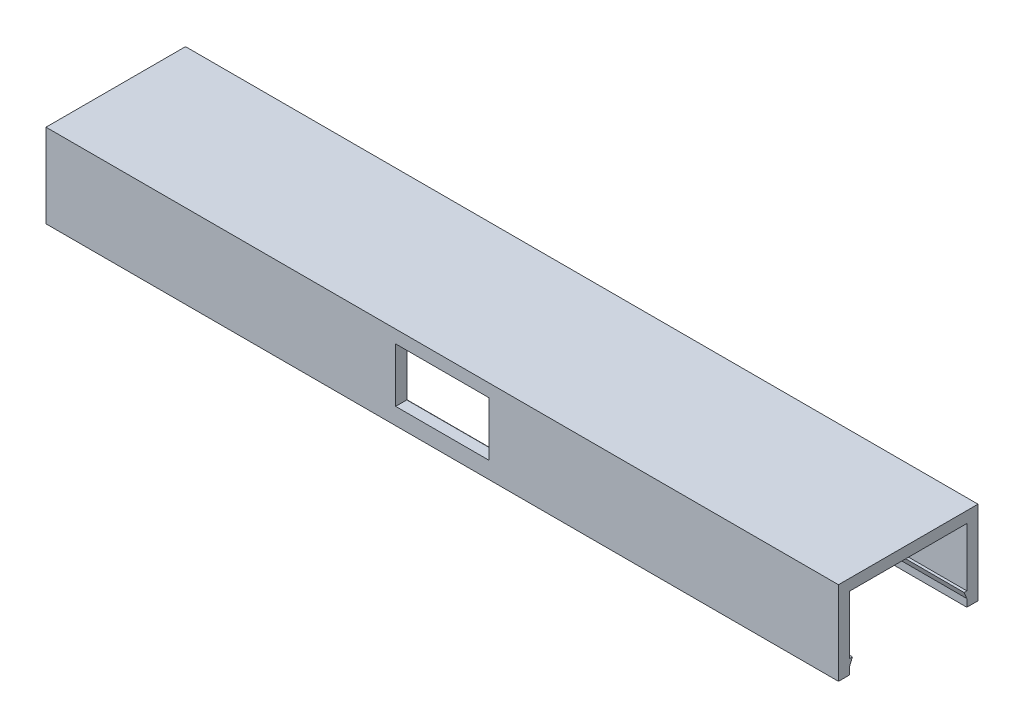
ISO-10303-21;
HEADER;
FILE_DESCRIPTION(('STEP AP214'),'2;1');
FILE_NAME('part.step','',(''),(''),'','','');
FILE_SCHEMA(('AUTOMOTIVE_DESIGN { 1 0 10303 214 1 1 1 1 }'));
ENDSEC;
DATA;
#1=APPLICATION_CONTEXT('core data for automotive mechanical design processes');
#2=APPLICATION_PROTOCOL_DEFINITION('international standard','automotive_design',2000,#1);
#3=PRODUCT_CONTEXT('',#1,'mechanical');
#4=PRODUCT('Part','Part','',(#3));
#5=PRODUCT_RELATED_PRODUCT_CATEGORY('part','',(#4));
#6=PRODUCT_DEFINITION_FORMATION('','',#4);
#7=PRODUCT_DEFINITION_CONTEXT('part definition',#1,'design');
#8=PRODUCT_DEFINITION('design','',#6,#7);
#9=PRODUCT_DEFINITION_SHAPE('','',#8);
#10=(LENGTH_UNIT() NAMED_UNIT(*) SI_UNIT(.MILLI.,.METRE.));
#11=(NAMED_UNIT(*) PLANE_ANGLE_UNIT() SI_UNIT($,.RADIAN.));
#12=(NAMED_UNIT(*) SI_UNIT($,.STERADIAN.) SOLID_ANGLE_UNIT());
#13=UNCERTAINTY_MEASURE_WITH_UNIT(LENGTH_MEASURE(1.E-05),#10,'distance_accuracy_value','');
#14=(GEOMETRIC_REPRESENTATION_CONTEXT(3) GLOBAL_UNCERTAINTY_ASSIGNED_CONTEXT((#13)) GLOBAL_UNIT_ASSIGNED_CONTEXT((#10,
#11,#12)) REPRESENTATION_CONTEXT('',''));
#15=CARTESIAN_POINT('',(0.,0.,0.));
#16=DIRECTION('',(0.,0.,1.));
#17=DIRECTION('',(1.,0.,0.));
#18=AXIS2_PLACEMENT_3D('',#15,#16,#17);
#19=CARTESIAN_POINT('',(159.,13.,10.5));
#20=DIRECTION('',(0.,0.,1.));
#21=DIRECTION('',(1.,0.,0.));
#22=AXIS2_PLACEMENT_3D('',#19,#20,#21);
#23=PLANE('',#22);
#24=DIRECTION('',(-1.,0.,0.));
#25=VECTOR('',#24,1.);
#26=CARTESIAN_POINT('',(159.,12.7,10.5));
#27=LINE('',#26,#25);
#28=CARTESIAN_POINT('',(8.35,12.7,10.5));
#29=VERTEX_POINT('',#28);
#30=CARTESIAN_POINT('',(-8.35,12.7,10.5));
#31=VERTEX_POINT('',#30);
#32=EDGE_CURVE('E191',#29,#31,#27,.T.);
#33=ORIENTED_EDGE('',*,*,#32,.T.);
#34=DIRECTION('',(0.,-1.,0.));
#35=VECTOR('',#34,1.);
#36=CARTESIAN_POINT('',(-8.35,13.,10.5));
#37=LINE('',#36,#35);
#38=CARTESIAN_POINT('',(-8.35,3.,10.5));
#39=VERTEX_POINT('',#38);
#40=EDGE_CURVE('E194',#31,#39,#37,.T.);
#41=ORIENTED_EDGE('',*,*,#40,.T.);
#42=DIRECTION('',(1.,0.,0.));
#43=VECTOR('',#42,1.);
#44=CARTESIAN_POINT('',(159.,3.,10.5));
#45=LINE('',#44,#43);
#46=CARTESIAN_POINT('',(8.35,3.,10.5));
#47=VERTEX_POINT('',#46);
#48=EDGE_CURVE('E186',#39,#47,#45,.T.);
#49=ORIENTED_EDGE('',*,*,#48,.T.);
#50=DIRECTION('',(0.,1.,0.));
#51=VECTOR('',#50,1.);
#52=CARTESIAN_POINT('',(8.35,12.9999999999999,10.5));
#53=LINE('',#52,#51);
#54=EDGE_CURVE('E166',#47,#29,#53,.T.);
#55=ORIENTED_EDGE('',*,*,#54,.T.);
#56=EDGE_LOOP('',(#33,#41,#49,#55));
#57=FACE_BOUND('',#56,.T.);
#58=DIRECTION('',(0.,1.,0.));
#59=VECTOR('',#58,1.);
#60=CARTESIAN_POINT('',(71.,15.,10.5));
#61=LINE('',#60,#59);
#62=CARTESIAN_POINT('',(71.,2.55,10.5));
#63=VERTEX_POINT('',#62);
#64=CARTESIAN_POINT('',(71.,13.,10.5));
#65=VERTEX_POINT('',#64);
#66=EDGE_CURVE('E253',#63,#65,#61,.T.);
#67=ORIENTED_EDGE('',*,*,#66,.F.);
#68=DIRECTION('',(-1.,0.,0.));
#69=VECTOR('',#68,1.);
#70=CARTESIAN_POINT('',(72.3,2.55,10.5));
#71=LINE('',#70,#69);
#72=CARTESIAN_POINT('',(-71.,2.55,10.5));
#73=VERTEX_POINT('',#72);
#74=EDGE_CURVE('E202',#63,#73,#71,.T.);
#75=ORIENTED_EDGE('',*,*,#74,.T.);
#76=DIRECTION('',(0.,1.,0.));
#77=VECTOR('',#76,1.);
#78=CARTESIAN_POINT('',(-71.,13.,10.5));
#79=LINE('',#78,#77);
#80=CARTESIAN_POINT('',(-71.,13.,10.5));
#81=VERTEX_POINT('',#80);
#82=EDGE_CURVE('E240',#73,#81,#79,.T.);
#83=ORIENTED_EDGE('',*,*,#82,.T.);
#84=DIRECTION('',(-1.,0.,0.));
#85=VECTOR('',#84,1.);
#86=CARTESIAN_POINT('',(159.,13.,10.5));
#87=LINE('',#86,#85);
#88=EDGE_CURVE('E245',#65,#81,#87,.T.);
#89=ORIENTED_EDGE('',*,*,#88,.F.);
#90=EDGE_LOOP('',(#67,#75,#83,#89));
#91=FACE_BOUND('',#90,.T.);
#92=ADVANCED_FACE('F35',(#57,#91),#23,.F.);
#93=CARTESIAN_POINT('',(159.,13.,-10.5));
#94=DIRECTION('',(0.,0.,-1.));
#95=DIRECTION('',(-1.,0.,0.));
#96=AXIS2_PLACEMENT_3D('',#93,#94,#95);
#97=PLANE('',#96);
#98=DIRECTION('',(0.,-1.,0.));
#99=VECTOR('',#98,1.);
#100=CARTESIAN_POINT('',(71.,15.,-10.5));
#101=LINE('',#100,#99);
#102=CARTESIAN_POINT('',(71.,1.35,-10.5));
#103=VERTEX_POINT('',#102);
#104=CARTESIAN_POINT('',(71.,0.,-10.5));
#105=VERTEX_POINT('',#104);
#106=EDGE_CURVE('E248',#103,#105,#101,.T.);
#107=ORIENTED_EDGE('',*,*,#106,.F.);
#108=DIRECTION('',(-1.,0.,0.));
#109=VECTOR('',#108,1.);
#110=CARTESIAN_POINT('',(72.3,1.35,-10.5));
#111=LINE('',#110,#109);
#112=CARTESIAN_POINT('',(-71.,1.35,-10.5));
#113=VERTEX_POINT('',#112);
#114=EDGE_CURVE('E220',#103,#113,#111,.T.);
#115=ORIENTED_EDGE('',*,*,#114,.T.);
#116=DIRECTION('',(0.,-1.,0.));
#117=VECTOR('',#116,1.);
#118=CARTESIAN_POINT('',(-71.,13.,-10.5));
#119=LINE('',#118,#117);
#120=CARTESIAN_POINT('',(-71.,0.,-10.5));
#121=VERTEX_POINT('',#120);
#122=EDGE_CURVE('E236',#113,#121,#119,.T.);
#123=ORIENTED_EDGE('',*,*,#122,.T.);
#124=DIRECTION('',(-1.,0.,0.));
#125=VECTOR('',#124,1.);
#126=CARTESIAN_POINT('',(0.,0.,-10.5));
#127=LINE('',#126,#125);
#128=EDGE_CURVE('E43',#105,#121,#127,.T.);
#129=ORIENTED_EDGE('',*,*,#128,.F.);
#130=EDGE_LOOP('',(#107,#115,#123,#129));
#131=FACE_BOUND('',#130,.T.);
#132=ADVANCED_FACE('F314',(#131),#97,.F.);
#133=CARTESIAN_POINT('',(0.,0.,0.));
#134=DIRECTION('',(0.,1.,0.));
#135=DIRECTION('',(0.,0.,1.));
#136=AXIS2_PLACEMENT_3D('',#133,#134,#135);
#137=PLANE('',#136);
#138=DIRECTION('',(0.,0.,-1.));
#139=VECTOR('',#138,1.);
#140=CARTESIAN_POINT('',(-71.,0.,0.));
#141=LINE('',#140,#139);
#142=CARTESIAN_POINT('',(-71.,0.,12.5));
#143=VERTEX_POINT('',#142);
#144=CARTESIAN_POINT('',(-71.,0.,10.5));
#145=VERTEX_POINT('',#144);
#146=EDGE_CURVE('E280',#143,#145,#141,.T.);
#147=ORIENTED_EDGE('',*,*,#146,.T.);
#148=DIRECTION('',(1.,0.,0.));
#149=VECTOR('',#148,1.);
#150=CARTESIAN_POINT('',(0.,0.,10.5));
#151=LINE('',#150,#149);
#152=CARTESIAN_POINT('',(71.,0.,10.5));
#153=VERTEX_POINT('',#152);
#154=EDGE_CURVE('E11',#145,#153,#151,.T.);
#155=ORIENTED_EDGE('',*,*,#154,.T.);
#156=DIRECTION('',(0.,0.,-1.));
#157=VECTOR('',#156,1.);
#158=CARTESIAN_POINT('',(71.,0.,0.));
#159=LINE('',#158,#157);
#160=CARTESIAN_POINT('',(71.,0.,12.5));
#161=VERTEX_POINT('',#160);
#162=EDGE_CURVE('E273',#161,#153,#159,.T.);
#163=ORIENTED_EDGE('',*,*,#162,.F.);
#164=DIRECTION('',(1.,0.,0.));
#165=VECTOR('',#164,1.);
#166=CARTESIAN_POINT('',(0.,0.,12.5));
#167=LINE('',#166,#165);
#168=EDGE_CURVE('E264',#143,#161,#167,.T.);
#169=ORIENTED_EDGE('',*,*,#168,.F.);
#170=EDGE_LOOP('',(#147,#155,#163,#169));
#171=FACE_BOUND('',#170,.T.);
#172=ADVANCED_FACE('F346',(#171),#137,.F.);
#173=CARTESIAN_POINT('',(71.,15.,0.));
#174=DIRECTION('',(-1.,0.,0.));
#175=DIRECTION('',(0.,0.,1.));
#176=AXIS2_PLACEMENT_3D('',#173,#174,#175);
#177=PLANE('',#176);
#178=ORIENTED_EDGE('',*,*,#162,.T.);
#179=CARTESIAN_POINT('',(71.,1.35,10.5));
#180=VERTEX_POINT('',#179);
#181=EDGE_CURVE('E254',#153,#180,#61,.T.);
#182=ORIENTED_EDGE('',*,*,#181,.T.);
#183=DIRECTION('',(0.,0.923076923076923,-0.384615384615384));
#184=VECTOR('',#183,1.);
#185=CARTESIAN_POINT('',(71.,2.55,10.));
#186=LINE('',#185,#184);
#187=CARTESIAN_POINT('',(71.,2.55,10.));
#188=VERTEX_POINT('',#187);
#189=EDGE_CURVE('E201',#180,#188,#186,.T.);
#190=ORIENTED_EDGE('',*,*,#189,.T.);
#191=DIRECTION('',(0.,0.,1.));
#192=VECTOR('',#191,1.);
#193=CARTESIAN_POINT('',(71.,2.55,10.5));
#194=LINE('',#193,#192);
#195=EDGE_CURVE('E198',#188,#63,#194,.T.);
#196=ORIENTED_EDGE('',*,*,#195,.T.);
#197=ORIENTED_EDGE('',*,*,#66,.T.);
#198=DIRECTION('',(0.,0.,-1.));
#199=VECTOR('',#198,1.);
#200=CARTESIAN_POINT('',(71.,13.,0.));
#201=LINE('',#200,#199);
#202=CARTESIAN_POINT('',(71.,13.,-10.5));
#203=VERTEX_POINT('',#202);
#204=EDGE_CURVE('E257',#65,#203,#201,.T.);
#205=ORIENTED_EDGE('',*,*,#204,.T.);
#206=CARTESIAN_POINT('',(71.,2.55,-10.5));
#207=VERTEX_POINT('',#206);
#208=EDGE_CURVE('E250',#203,#207,#101,.T.);
#209=ORIENTED_EDGE('',*,*,#208,.T.);
#210=DIRECTION('',(0.,0.,1.));
#211=VECTOR('',#210,1.);
#212=CARTESIAN_POINT('',(71.,2.55,-10.5));
#213=LINE('',#212,#211);
#214=CARTESIAN_POINT('',(71.,2.55,-10.));
#215=VERTEX_POINT('',#214);
#216=EDGE_CURVE('E219',#207,#215,#213,.T.);
#217=ORIENTED_EDGE('',*,*,#216,.T.);
#218=DIRECTION('',(0.,-0.923076923076923,-0.384615384615384));
#219=VECTOR('',#218,1.);
#220=CARTESIAN_POINT('',(71.,2.55,-10.));
#221=LINE('',#220,#219);
#222=EDGE_CURVE('E216',#215,#103,#221,.T.);
#223=ORIENTED_EDGE('',*,*,#222,.T.);
#224=ORIENTED_EDGE('',*,*,#106,.T.);
#225=CARTESIAN_POINT('',(71.,0.,-12.5));
#226=VERTEX_POINT('',#225);
#227=EDGE_CURVE('E260',#105,#226,#159,.T.);
#228=ORIENTED_EDGE('',*,*,#227,.T.);
#229=DIRECTION('',(0.,-1.,0.));
#230=VECTOR('',#229,1.);
#231=CARTESIAN_POINT('',(71.,15.,-12.5));
#232=LINE('',#231,#230);
#233=CARTESIAN_POINT('',(71.,15.,-12.5));
#234=VERTEX_POINT('',#233);
#235=EDGE_CURVE('E291',#234,#226,#232,.T.);
#236=ORIENTED_EDGE('',*,*,#235,.F.);
#237=DIRECTION('',(0.,0.,-1.));
#238=VECTOR('',#237,1.);
#239=CARTESIAN_POINT('',(71.,15.,0.));
#240=LINE('',#239,#238);
#241=CARTESIAN_POINT('',(71.,15.,12.5));
#242=VERTEX_POINT('',#241);
#243=EDGE_CURVE('E261',#242,#234,#240,.T.);
#244=ORIENTED_EDGE('',*,*,#243,.F.);
#245=DIRECTION('',(0.,-1.,0.));
#246=VECTOR('',#245,1.);
#247=CARTESIAN_POINT('',(71.,15.,12.5));
#248=LINE('',#247,#246);
#249=EDGE_CURVE('E272',#242,#161,#248,.T.);
#250=ORIENTED_EDGE('',*,*,#249,.T.);
#251=EDGE_LOOP('',(#178,#182,#190,#196,#197,#205,#209,#217,#223,#224,#228,#236,#244,#250));
#252=FACE_BOUND('',#251,.T.);
#253=ADVANCED_FACE('F37',(#252),#177,.F.);
#254=CARTESIAN_POINT('',(0.,15.,-12.5));
#255=DIRECTION('',(0.,0.,-1.));
#256=DIRECTION('',(-1.,0.,0.));
#257=AXIS2_PLACEMENT_3D('',#254,#255,#256);
#258=PLANE('',#257);
#259=DIRECTION('',(1.,0.,0.));
#260=VECTOR('',#259,1.);
#261=CARTESIAN_POINT('',(0.,0.,-12.5));
#262=LINE('',#261,#260);
#263=CARTESIAN_POINT('',(-71.,0.,-12.5));
#264=VERTEX_POINT('',#263);
#265=EDGE_CURVE('E276',#264,#226,#262,.T.);
#266=ORIENTED_EDGE('',*,*,#265,.F.);
#267=DIRECTION('',(0.,-1.,0.));
#268=VECTOR('',#267,1.);
#269=CARTESIAN_POINT('',(-71.,15.,-12.5));
#270=LINE('',#269,#268);
#271=CARTESIAN_POINT('',(-71.,15.,-12.5));
#272=VERTEX_POINT('',#271);
#273=EDGE_CURVE('E288',#272,#264,#270,.T.);
#274=ORIENTED_EDGE('',*,*,#273,.F.);
#275=DIRECTION('',(1.,0.,0.));
#276=VECTOR('',#275,1.);
#277=CARTESIAN_POINT('',(0.,15.,-12.5));
#278=LINE('',#277,#276);
#279=EDGE_CURVE('E263',#272,#234,#278,.T.);
#280=ORIENTED_EDGE('',*,*,#279,.T.);
#281=ORIENTED_EDGE('',*,*,#235,.T.);
#282=EDGE_LOOP('',(#266,#274,#280,#281));
#283=FACE_BOUND('',#282,.T.);
#284=ADVANCED_FACE('F309',(#283),#258,.T.);
#285=CARTESIAN_POINT('',(-71.,15.,0.));
#286=DIRECTION('',(-1.,0.,0.));
#287=DIRECTION('',(0.,0.,1.));
#288=AXIS2_PLACEMENT_3D('',#285,#286,#287);
#289=PLANE('',#288);
#290=CARTESIAN_POINT('',(-71.,1.35,10.5));
#291=VERTEX_POINT('',#290);
#292=EDGE_CURVE('E241',#145,#291,#79,.T.);
#293=ORIENTED_EDGE('',*,*,#292,.F.);
#294=ORIENTED_EDGE('',*,*,#146,.F.);
#295=DIRECTION('',(0.,-1.,0.));
#296=VECTOR('',#295,1.);
#297=CARTESIAN_POINT('',(-71.,15.,12.5));
#298=LINE('',#297,#296);
#299=CARTESIAN_POINT('',(-71.,15.,12.5));
#300=VERTEX_POINT('',#299);
#301=EDGE_CURVE('E286',#300,#143,#298,.T.);
#302=ORIENTED_EDGE('',*,*,#301,.F.);
#303=DIRECTION('',(0.,0.,-1.));
#304=VECTOR('',#303,1.);
#305=CARTESIAN_POINT('',(-71.,15.,0.));
#306=LINE('',#305,#304);
#307=EDGE_CURVE('E267',#300,#272,#306,.T.);
#308=ORIENTED_EDGE('',*,*,#307,.T.);
#309=ORIENTED_EDGE('',*,*,#273,.T.);
#310=EDGE_CURVE('E279',#121,#264,#141,.T.);
#311=ORIENTED_EDGE('',*,*,#310,.F.);
#312=ORIENTED_EDGE('',*,*,#122,.F.);
#313=DIRECTION('',(0.,0.923076923076923,0.384615384615384));
#314=VECTOR('',#313,1.);
#315=CARTESIAN_POINT('',(-71.,2.55,-10.));
#316=LINE('',#315,#314);
#317=CARTESIAN_POINT('',(-71.,2.55,-10.));
#318=VERTEX_POINT('',#317);
#319=EDGE_CURVE('E215',#113,#318,#316,.T.);
#320=ORIENTED_EDGE('',*,*,#319,.T.);
#321=DIRECTION('',(0.,0.,-1.));
#322=VECTOR('',#321,1.);
#323=CARTESIAN_POINT('',(-71.,2.55,-10.5));
#324=LINE('',#323,#322);
#325=CARTESIAN_POINT('',(-71.,2.55,-10.5));
#326=VERTEX_POINT('',#325);
#327=EDGE_CURVE('E223',#318,#326,#324,.T.);
#328=ORIENTED_EDGE('',*,*,#327,.T.);
#329=CARTESIAN_POINT('',(-71.,13.,-10.5));
#330=VERTEX_POINT('',#329);
#331=EDGE_CURVE('E237',#330,#326,#119,.T.);
#332=ORIENTED_EDGE('',*,*,#331,.F.);
#333=DIRECTION('',(0.,0.,-1.));
#334=VECTOR('',#333,1.);
#335=CARTESIAN_POINT('',(-71.,13.,-10.5));
#336=LINE('',#335,#334);
#337=EDGE_CURVE('E233',#81,#330,#336,.T.);
#338=ORIENTED_EDGE('',*,*,#337,.F.);
#339=ORIENTED_EDGE('',*,*,#82,.F.);
#340=DIRECTION('',(0.,0.,-1.));
#341=VECTOR('',#340,1.);
#342=CARTESIAN_POINT('',(-71.,2.55,10.5));
#343=LINE('',#342,#341);
#344=CARTESIAN_POINT('',(-71.,2.55,10.));
#345=VERTEX_POINT('',#344);
#346=EDGE_CURVE('E197',#73,#345,#343,.T.);
#347=ORIENTED_EDGE('',*,*,#346,.T.);
#348=DIRECTION('',(0.,-0.923076923076923,0.384615384615384));
#349=VECTOR('',#348,1.);
#350=CARTESIAN_POINT('',(-71.,2.55,10.));
#351=LINE('',#350,#349);
#352=EDGE_CURVE('E205',#345,#291,#351,.T.);
#353=ORIENTED_EDGE('',*,*,#352,.T.);
#354=EDGE_LOOP('',(#293,#294,#302,#308,#309,#311,#312,#320,#328,#332,#338,#339,#347,#353));
#355=FACE_BOUND('',#354,.T.);
#356=ADVANCED_FACE('F304',(#355),#289,.T.);
#357=CARTESIAN_POINT('',(0.,15.,12.5));
#358=DIRECTION('',(0.,0.,-1.));
#359=DIRECTION('',(-1.,0.,0.));
#360=AXIS2_PLACEMENT_3D('',#357,#358,#359);
#361=PLANE('',#360);
#362=DIRECTION('',(1.,0.,0.));
#363=VECTOR('',#362,1.);
#364=CARTESIAN_POINT('',(-8.35,3.,12.5));
#365=LINE('',#364,#363);
#366=CARTESIAN_POINT('',(-8.35,3.,12.5));
#367=VERTEX_POINT('',#366);
#368=CARTESIAN_POINT('',(8.35,3.,12.5));
#369=VERTEX_POINT('',#368);
#370=EDGE_CURVE('E172',#367,#369,#365,.T.);
#371=ORIENTED_EDGE('',*,*,#370,.F.);
#372=DIRECTION('',(0.,-1.,0.));
#373=VECTOR('',#372,1.);
#374=CARTESIAN_POINT('',(-8.35,3.,12.5));
#375=LINE('',#374,#373);
#376=CARTESIAN_POINT('',(-8.35,12.7,12.5));
#377=VERTEX_POINT('',#376);
#378=EDGE_CURVE('E58',#377,#367,#375,.T.);
#379=ORIENTED_EDGE('',*,*,#378,.F.);
#380=DIRECTION('',(-1.,0.,0.));
#381=VECTOR('',#380,1.);
#382=CARTESIAN_POINT('',(-8.35,12.7,12.5));
#383=LINE('',#382,#381);
#384=CARTESIAN_POINT('',(8.35,12.7,12.5));
#385=VERTEX_POINT('',#384);
#386=EDGE_CURVE('E179',#385,#377,#383,.T.);
#387=ORIENTED_EDGE('',*,*,#386,.F.);
#388=DIRECTION('',(0.,1.,0.));
#389=VECTOR('',#388,1.);
#390=CARTESIAN_POINT('',(8.35,3.,12.5));
#391=LINE('',#390,#389);
#392=EDGE_CURVE('E163',#369,#385,#391,.T.);
#393=ORIENTED_EDGE('',*,*,#392,.F.);
#394=EDGE_LOOP('',(#371,#379,#387,#393));
#395=FACE_BOUND('',#394,.T.);
#396=ORIENTED_EDGE('',*,*,#168,.T.);
#397=ORIENTED_EDGE('',*,*,#249,.F.);
#398=DIRECTION('',(1.,0.,0.));
#399=VECTOR('',#398,1.);
#400=CARTESIAN_POINT('',(0.,15.,12.5));
#401=LINE('',#400,#399);
#402=EDGE_CURVE('E270',#300,#242,#401,.T.);
#403=ORIENTED_EDGE('',*,*,#402,.F.);
#404=ORIENTED_EDGE('',*,*,#301,.T.);
#405=EDGE_LOOP('',(#396,#397,#403,#404));
#406=FACE_BOUND('',#405,.T.);
#407=ADVANCED_FACE('F176',(#395,#406),#361,.F.);
#408=CARTESIAN_POINT('',(0.,15.,0.));
#409=DIRECTION('',(0.,1.,0.));
#410=DIRECTION('',(0.,0.,1.));
#411=AXIS2_PLACEMENT_3D('',#408,#409,#410);
#412=PLANE('',#411);
#413=ORIENTED_EDGE('',*,*,#243,.T.);
#414=ORIENTED_EDGE('',*,*,#279,.F.);
#415=ORIENTED_EDGE('',*,*,#307,.F.);
#416=ORIENTED_EDGE('',*,*,#402,.T.);
#417=EDGE_LOOP('',(#413,#414,#415,#416));
#418=FACE_BOUND('',#417,.T.);
#419=ADVANCED_FACE('F351',(#418),#412,.T.);
#420=ORIENTED_EDGE('',*,*,#227,.F.);
#421=ORIENTED_EDGE('',*,*,#128,.T.);
#422=ORIENTED_EDGE('',*,*,#310,.T.);
#423=ORIENTED_EDGE('',*,*,#265,.T.);
#424=EDGE_LOOP('',(#420,#421,#422,#423));
#425=FACE_BOUND('',#424,.T.);
#426=ADVANCED_FACE('F298',(#425),#137,.F.);
#427=CARTESIAN_POINT('',(159.,13.,-10.5));
#428=DIRECTION('',(0.,1.,0.));
#429=DIRECTION('',(0.,0.,1.));
#430=AXIS2_PLACEMENT_3D('',#427,#428,#429);
#431=PLANE('',#430);
#432=ORIENTED_EDGE('',*,*,#88,.T.);
#433=ORIENTED_EDGE('',*,*,#337,.T.);
#434=DIRECTION('',(-1.,0.,0.));
#435=VECTOR('',#434,1.);
#436=CARTESIAN_POINT('',(159.,13.,-10.5));
#437=LINE('',#436,#435);
#438=EDGE_CURVE('E244',#203,#330,#437,.T.);
#439=ORIENTED_EDGE('',*,*,#438,.F.);
#440=ORIENTED_EDGE('',*,*,#204,.F.);
#441=EDGE_LOOP('',(#432,#433,#439,#440));
#442=FACE_BOUND('',#441,.T.);
#443=ADVANCED_FACE('F328',(#442),#431,.F.);
#444=ORIENTED_EDGE('',*,*,#292,.T.);
#445=DIRECTION('',(-1.,0.,0.));
#446=VECTOR('',#445,1.);
#447=CARTESIAN_POINT('',(72.3,1.35,10.5));
#448=LINE('',#447,#446);
#449=EDGE_CURVE('E211',#180,#291,#448,.T.);
#450=ORIENTED_EDGE('',*,*,#449,.F.);
#451=ORIENTED_EDGE('',*,*,#181,.F.);
#452=ORIENTED_EDGE('',*,*,#154,.F.);
#453=EDGE_LOOP('',(#444,#450,#451,#452));
#454=FACE_BOUND('',#453,.T.);
#455=ADVANCED_FACE('F342',(#454),#23,.F.);
#456=ORIENTED_EDGE('',*,*,#331,.T.);
#457=DIRECTION('',(-1.,0.,0.));
#458=VECTOR('',#457,1.);
#459=CARTESIAN_POINT('',(72.3,2.55,-10.5));
#460=LINE('',#459,#458);
#461=EDGE_CURVE('E229',#207,#326,#460,.T.);
#462=ORIENTED_EDGE('',*,*,#461,.F.);
#463=ORIENTED_EDGE('',*,*,#208,.F.);
#464=ORIENTED_EDGE('',*,*,#438,.T.);
#465=EDGE_LOOP('',(#456,#462,#463,#464));
#466=FACE_BOUND('',#465,.T.);
#467=ADVANCED_FACE('F324',(#466),#97,.F.);
#468=CARTESIAN_POINT('',(72.3,2.55,-10.));
#469=DIRECTION('',(0.,-0.384615384615384,0.923076923076924));
#470=DIRECTION('',(0.,-0.923076923076923,-0.384615384615384));
#471=AXIS2_PLACEMENT_3D('',#468,#469,#470);
#472=PLANE('',#471);
#473=ORIENTED_EDGE('',*,*,#222,.F.);
#474=DIRECTION('',(-1.,0.,0.));
#475=VECTOR('',#474,1.);
#476=CARTESIAN_POINT('',(72.3,2.55,-10.));
#477=LINE('',#476,#475);
#478=EDGE_CURVE('E226',#215,#318,#477,.T.);
#479=ORIENTED_EDGE('',*,*,#478,.T.);
#480=ORIENTED_EDGE('',*,*,#319,.F.);
#481=ORIENTED_EDGE('',*,*,#114,.F.);
#482=EDGE_LOOP('',(#473,#479,#480,#481));
#483=FACE_BOUND('',#482,.T.);
#484=ADVANCED_FACE('F316',(#483),#472,.T.);
#485=CARTESIAN_POINT('',(72.3,2.55,-10.5));
#486=DIRECTION('',(0.,1.,0.));
#487=DIRECTION('',(0.,0.,1.));
#488=AXIS2_PLACEMENT_3D('',#485,#486,#487);
#489=PLANE('',#488);
#490=ORIENTED_EDGE('',*,*,#216,.F.);
#491=ORIENTED_EDGE('',*,*,#461,.T.);
#492=ORIENTED_EDGE('',*,*,#327,.F.);
#493=ORIENTED_EDGE('',*,*,#478,.F.);
#494=EDGE_LOOP('',(#490,#491,#492,#493));
#495=FACE_BOUND('',#494,.T.);
#496=ADVANCED_FACE('F471',(#495),#489,.T.);
#497=CARTESIAN_POINT('',(72.3,2.55,10.5));
#498=DIRECTION('',(0.,1.,0.));
#499=DIRECTION('',(0.,0.,1.));
#500=AXIS2_PLACEMENT_3D('',#497,#498,#499);
#501=PLANE('',#500);
#502=ORIENTED_EDGE('',*,*,#195,.F.);
#503=DIRECTION('',(-1.,0.,0.));
#504=VECTOR('',#503,1.);
#505=CARTESIAN_POINT('',(72.3,2.55,10.));
#506=LINE('',#505,#504);
#507=EDGE_CURVE('E208',#188,#345,#506,.T.);
#508=ORIENTED_EDGE('',*,*,#507,.T.);
#509=ORIENTED_EDGE('',*,*,#346,.F.);
#510=ORIENTED_EDGE('',*,*,#74,.F.);
#511=EDGE_LOOP('',(#502,#508,#509,#510));
#512=FACE_BOUND('',#511,.T.);
#513=ADVANCED_FACE('F335',(#512),#501,.T.);
#514=CARTESIAN_POINT('',(72.3,2.55,10.));
#515=DIRECTION('',(0.,-0.384615384615384,-0.923076923076924));
#516=DIRECTION('',(0.,0.923076923076923,-0.384615384615384));
#517=AXIS2_PLACEMENT_3D('',#514,#515,#516);
#518=PLANE('',#517);
#519=ORIENTED_EDGE('',*,*,#189,.F.);
#520=ORIENTED_EDGE('',*,*,#449,.T.);
#521=ORIENTED_EDGE('',*,*,#352,.F.);
#522=ORIENTED_EDGE('',*,*,#507,.F.);
#523=EDGE_LOOP('',(#519,#520,#521,#522));
#524=FACE_BOUND('',#523,.T.);
#525=ADVANCED_FACE('F339',(#524),#518,.T.);
#526=CARTESIAN_POINT('',(-8.35,3.,2.5));
#527=DIRECTION('',(-1.,0.,0.));
#528=DIRECTION('',(0.,-1.,0.));
#529=AXIS2_PLACEMENT_3D('',#526,#527,#528);
#530=PLANE('',#529);
#531=DIRECTION('',(0.,0.,1.));
#532=VECTOR('',#531,1.);
#533=CARTESIAN_POINT('',(-8.35,12.7,2.5));
#534=LINE('',#533,#532);
#535=EDGE_CURVE('E184',#31,#377,#534,.T.);
#536=ORIENTED_EDGE('',*,*,#535,.T.);
#537=ORIENTED_EDGE('',*,*,#378,.T.);
#538=DIRECTION('',(0.,0.,1.));
#539=VECTOR('',#538,1.);
#540=CARTESIAN_POINT('',(-8.35,3.,2.5));
#541=LINE('',#540,#539);
#542=EDGE_CURVE('E169',#39,#367,#541,.T.);
#543=ORIENTED_EDGE('',*,*,#542,.F.);
#544=ORIENTED_EDGE('',*,*,#40,.F.);
#545=EDGE_LOOP('',(#536,#537,#543,#544));
#546=FACE_BOUND('',#545,.T.);
#547=ADVANCED_FACE('F431',(#546),#530,.F.);
#548=CARTESIAN_POINT('',(-8.35,12.7,2.5));
#549=DIRECTION('',(0.,1.,0.));
#550=DIRECTION('',(0.,0.,1.));
#551=AXIS2_PLACEMENT_3D('',#548,#549,#550);
#552=PLANE('',#551);
#553=DIRECTION('',(0.,0.,1.));
#554=VECTOR('',#553,1.);
#555=CARTESIAN_POINT('',(8.35,12.7,2.5));
#556=LINE('',#555,#554);
#557=EDGE_CURVE('E168',#29,#385,#556,.T.);
#558=ORIENTED_EDGE('',*,*,#557,.T.);
#559=ORIENTED_EDGE('',*,*,#386,.T.);
#560=ORIENTED_EDGE('',*,*,#535,.F.);
#561=ORIENTED_EDGE('',*,*,#32,.F.);
#562=EDGE_LOOP('',(#558,#559,#560,#561));
#563=FACE_BOUND('',#562,.T.);
#564=ADVANCED_FACE('F436',(#563),#552,.F.);
#565=CARTESIAN_POINT('',(8.35,3.,2.5));
#566=DIRECTION('',(1.,0.,0.));
#567=DIRECTION('',(0.,1.,0.));
#568=AXIS2_PLACEMENT_3D('',#565,#566,#567);
#569=PLANE('',#568);
#570=DIRECTION('',(0.,0.,1.));
#571=VECTOR('',#570,1.);
#572=CARTESIAN_POINT('',(8.35,3.,2.5));
#573=LINE('',#572,#571);
#574=EDGE_CURVE('E50',#47,#369,#573,.T.);
#575=ORIENTED_EDGE('',*,*,#574,.T.);
#576=ORIENTED_EDGE('',*,*,#392,.T.);
#577=ORIENTED_EDGE('',*,*,#557,.F.);
#578=ORIENTED_EDGE('',*,*,#54,.F.);
#579=EDGE_LOOP('',(#575,#576,#577,#578));
#580=FACE_BOUND('',#579,.T.);
#581=ADVANCED_FACE('F160',(#580),#569,.F.);
#582=CARTESIAN_POINT('',(-8.35,3.,2.5));
#583=DIRECTION('',(0.,-1.,0.));
#584=DIRECTION('',(0.,0.,-1.));
#585=AXIS2_PLACEMENT_3D('',#582,#583,#584);
#586=PLANE('',#585);
#587=ORIENTED_EDGE('',*,*,#542,.T.);
#588=ORIENTED_EDGE('',*,*,#370,.T.);
#589=ORIENTED_EDGE('',*,*,#574,.F.);
#590=ORIENTED_EDGE('',*,*,#48,.F.);
#591=EDGE_LOOP('',(#587,#588,#589,#590));
#592=FACE_BOUND('',#591,.T.);
#593=ADVANCED_FACE('F173',(#592),#586,.F.);
#594=CLOSED_SHELL('',(#92,#132,#172,#253,#284,#356,#407,#419,#426,#443,#455,#467,#484,#496,#513,
#525,#547,#564,#581,#593));
#595=MANIFOLD_SOLID_BREP('B2',#594);
#596=ADVANCED_BREP_SHAPE_REPRESENTATION('',(#18,#595),#14);
#597=SHAPE_DEFINITION_REPRESENTATION(#9,#596);
ENDSEC;
END-ISO-10303-21;
